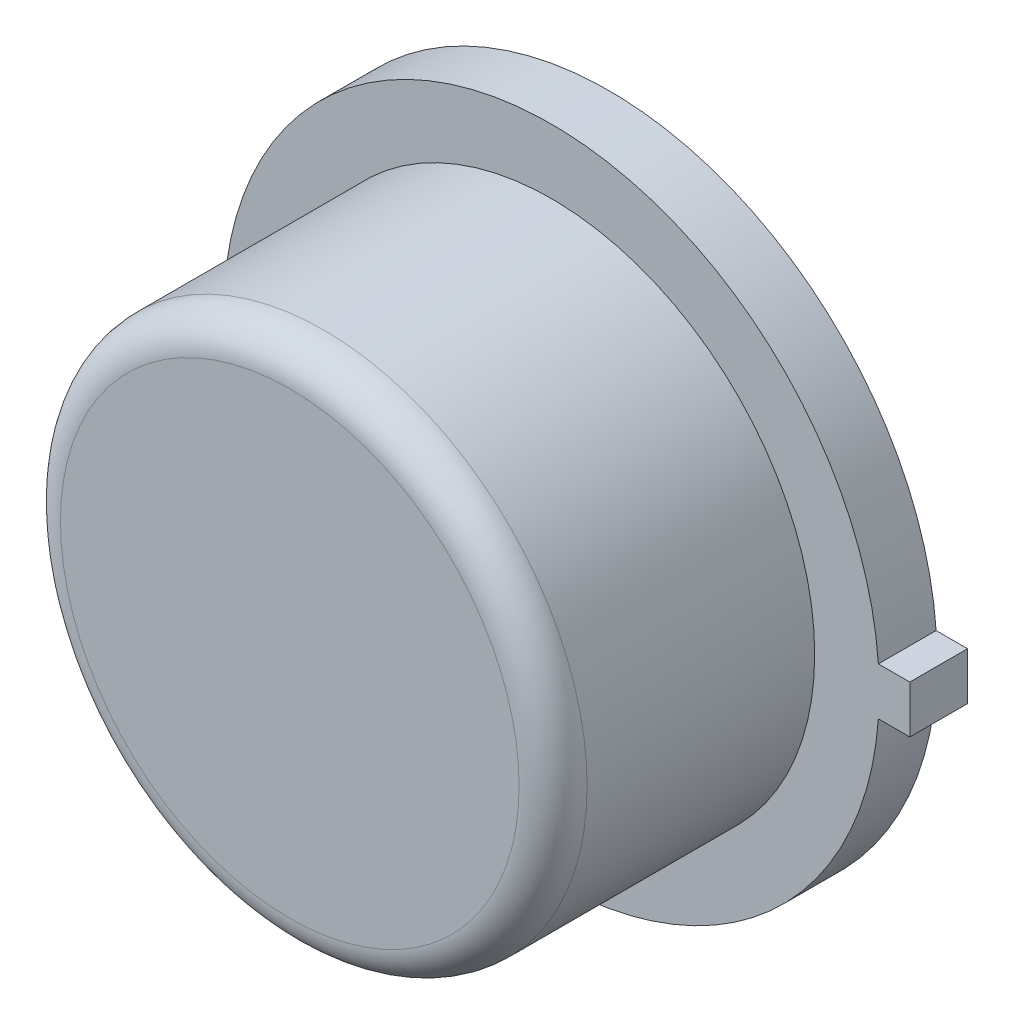
ISO-10303-21;
HEADER;
FILE_DESCRIPTION(('STEP AP214'),'2;1');
FILE_NAME('part.step','',(''),(''),'','','');
FILE_SCHEMA(('AUTOMOTIVE_DESIGN { 1 0 10303 214 1 1 1 1 }'));
ENDSEC;
DATA;
#1=APPLICATION_CONTEXT('core data for automotive mechanical design processes');
#2=APPLICATION_PROTOCOL_DEFINITION('international standard','automotive_design',2000,#1);
#3=PRODUCT_CONTEXT('',#1,'mechanical');
#4=PRODUCT('Part','Part','',(#3));
#5=PRODUCT_RELATED_PRODUCT_CATEGORY('part','',(#4));
#6=PRODUCT_DEFINITION_FORMATION('','',#4);
#7=PRODUCT_DEFINITION_CONTEXT('part definition',#1,'design');
#8=PRODUCT_DEFINITION('design','',#6,#7);
#9=PRODUCT_DEFINITION_SHAPE('','',#8);
#10=(LENGTH_UNIT() NAMED_UNIT(*) SI_UNIT(.MILLI.,.METRE.));
#11=(NAMED_UNIT(*) PLANE_ANGLE_UNIT() SI_UNIT($,.RADIAN.));
#12=(NAMED_UNIT(*) SI_UNIT($,.STERADIAN.) SOLID_ANGLE_UNIT());
#13=UNCERTAINTY_MEASURE_WITH_UNIT(LENGTH_MEASURE(1.E-05),#10,'distance_accuracy_value','');
#14=(GEOMETRIC_REPRESENTATION_CONTEXT(3) GLOBAL_UNCERTAINTY_ASSIGNED_CONTEXT((#13)) GLOBAL_UNIT_ASSIGNED_CONTEXT((#10,
#11,#12)) REPRESENTATION_CONTEXT('',''));
#15=CARTESIAN_POINT('',(0.,0.,0.));
#16=DIRECTION('',(0.,0.,1.));
#17=DIRECTION('',(1.,0.,0.));
#18=AXIS2_PLACEMENT_3D('',#15,#16,#17);
#19=CARTESIAN_POINT('',(-0.00322860507148085,-5.53029106093277,0.));
#20=DIRECTION('',(0.,0.,1.));
#21=DIRECTION('',(1.,0.,0.));
#22=AXIS2_PLACEMENT_3D('',#19,#20,#21);
#23=PLANE('',#22);
#24=DIRECTION('',(1.,0.,0.));
#25=VECTOR('',#24,1.);
#26=CARTESIAN_POINT('',(-0.0032286050714822,0.177799999999999,0.));
#27=LINE('',#26,#25);
#28=CARTESIAN_POINT('',(2.44464278985704,0.177799999999999,0.));
#29=VERTEX_POINT('',#28);
#30=CARTESIAN_POINT('',(2.6797,0.177799999999999,0.));
#31=VERTEX_POINT('',#30);
#32=EDGE_CURVE('E102',#29,#31,#27,.T.);
#33=ORIENTED_EDGE('',*,*,#32,.T.);
#34=DIRECTION('',(0.,-1.,0.));
#35=VECTOR('',#34,1.);
#36=CARTESIAN_POINT('',(2.6797,-5.53029106093277,0.));
#37=LINE('',#36,#35);
#38=CARTESIAN_POINT('',(2.6797,-0.1778,0.));
#39=VERTEX_POINT('',#38);
#40=EDGE_CURVE('E108',#31,#39,#37,.T.);
#41=ORIENTED_EDGE('',*,*,#40,.T.);
#42=DIRECTION('',(-1.,0.,0.));
#43=VECTOR('',#42,1.);
#44=CARTESIAN_POINT('',(-0.00322860507148085,-0.1778,0.));
#45=LINE('',#44,#43);
#46=CARTESIAN_POINT('',(2.44464278985704,-0.1778,0.));
#47=VERTEX_POINT('',#46);
#48=EDGE_CURVE('E106',#39,#47,#45,.T.);
#49=ORIENTED_EDGE('',*,*,#48,.T.);
#50=CARTESIAN_POINT('',(0.,0.,0.));
#51=DIRECTION('',(0.,0.,1.));
#52=DIRECTION('',(1.,0.,0.));
#53=AXIS2_PLACEMENT_3D('',#50,#51,#52);
#54=CIRCLE('',#53,2.4511);
#55=EDGE_CURVE('E92',#29,#47,#54,.T.);
#56=ORIENTED_EDGE('',*,*,#55,.F.);
#57=EDGE_LOOP('',(#33,#41,#49,#56));
#58=FACE_BOUND('',#57,.T.);
#59=CARTESIAN_POINT('',(0.,0.,0.));
#60=DIRECTION('',(0.,0.,1.));
#61=DIRECTION('',(1.,0.,0.));
#62=AXIS2_PLACEMENT_3D('',#59,#60,#61);
#63=CIRCLE('',#62,1.75756648099992);
#64=CARTESIAN_POINT('',(1.75756648099992,0.,0.));
#65=VERTEX_POINT('',#64);
#66=EDGE_CURVE('E114',#65,#65,#63,.F.);
#67=ORIENTED_EDGE('',*,*,#66,.F.);
#68=EDGE_LOOP('',(#67));
#69=FACE_BOUND('',#68,.T.);
#70=ADVANCED_FACE('F33',(#58,#69),#23,.F.);
#71=CARTESIAN_POINT('',(-0.00322860507148085,-5.53029106093277,0.4318));
#72=DIRECTION('',(0.,0.,1.));
#73=DIRECTION('',(1.,0.,0.));
#74=AXIS2_PLACEMENT_3D('',#71,#72,#73);
#75=PLANE('',#74);
#76=DIRECTION('',(1.,0.,0.));
#77=VECTOR('',#76,1.);
#78=CARTESIAN_POINT('',(-0.0032286050714822,0.177799999999999,0.4318));
#79=LINE('',#78,#77);
#80=CARTESIAN_POINT('',(2.44464278985704,0.177799999999999,0.4318));
#81=VERTEX_POINT('',#80);
#82=CARTESIAN_POINT('',(2.6797,0.177799999999999,0.4318));
#83=VERTEX_POINT('',#82);
#84=EDGE_CURVE('E85',#81,#83,#79,.T.);
#85=ORIENTED_EDGE('',*,*,#84,.F.);
#86=CARTESIAN_POINT('',(0.,0.,0.4318));
#87=DIRECTION('',(0.,0.,1.));
#88=DIRECTION('',(1.,0.,0.));
#89=AXIS2_PLACEMENT_3D('',#86,#87,#88);
#90=CIRCLE('',#89,2.4511);
#91=CARTESIAN_POINT('',(2.44464278985704,-0.1778,0.4318));
#92=VERTEX_POINT('',#91);
#93=EDGE_CURVE('E78',#81,#92,#90,.T.);
#94=ORIENTED_EDGE('',*,*,#93,.T.);
#95=DIRECTION('',(-1.,0.,0.));
#96=VECTOR('',#95,1.);
#97=CARTESIAN_POINT('',(-0.00322860507148085,-0.1778,0.4318));
#98=LINE('',#97,#96);
#99=CARTESIAN_POINT('',(2.6797,-0.1778,0.4318));
#100=VERTEX_POINT('',#99);
#101=EDGE_CURVE('E84',#100,#92,#98,.T.);
#102=ORIENTED_EDGE('',*,*,#101,.F.);
#103=DIRECTION('',(0.,-1.,0.));
#104=VECTOR('',#103,1.);
#105=CARTESIAN_POINT('',(2.6797,-5.53029106093277,0.4318));
#106=LINE('',#105,#104);
#107=EDGE_CURVE('E97',#83,#100,#106,.T.);
#108=ORIENTED_EDGE('',*,*,#107,.F.);
#109=EDGE_LOOP('',(#85,#94,#102,#108));
#110=FACE_BOUND('',#109,.T.);
#111=CARTESIAN_POINT('',(0.,0.,0.4318));
#112=DIRECTION('',(0.,0.,1.));
#113=DIRECTION('',(1.,0.,0.));
#114=AXIS2_PLACEMENT_3D('',#111,#112,#113);
#115=CIRCLE('',#114,1.9685);
#116=CARTESIAN_POINT('',(1.9685,0.,0.4318));
#117=VERTEX_POINT('',#116);
#118=EDGE_CURVE('E104',#117,#117,#115,.T.);
#119=ORIENTED_EDGE('',*,*,#118,.F.);
#120=EDGE_LOOP('',(#119));
#121=FACE_BOUND('',#120,.T.);
#122=ADVANCED_FACE('F80',(#110,#121),#75,.T.);
#123=CARTESIAN_POINT('',(-0.0032286050714822,0.177799999999999,0.4318));
#124=DIRECTION('',(0.,1.,0.));
#125=DIRECTION('',(-1.,0.,0.));
#126=AXIS2_PLACEMENT_3D('',#123,#124,#125);
#127=PLANE('',#126);
#128=ORIENTED_EDGE('',*,*,#32,.F.);
#129=DIRECTION('',(0.,0.,-1.));
#130=VECTOR('',#129,1.);
#131=CARTESIAN_POINT('',(2.44464278985704,0.177799999999999,0.4318));
#132=LINE('',#131,#130);
#133=EDGE_CURVE('E72',#81,#29,#132,.T.);
#134=ORIENTED_EDGE('',*,*,#133,.F.);
#135=ORIENTED_EDGE('',*,*,#84,.T.);
#136=DIRECTION('',(0.,0.,-1.));
#137=VECTOR('',#136,1.);
#138=CARTESIAN_POINT('',(2.6797,0.177799999999999,0.4318));
#139=LINE('',#138,#137);
#140=EDGE_CURVE('E50',#83,#31,#139,.T.);
#141=ORIENTED_EDGE('',*,*,#140,.T.);
#142=EDGE_LOOP('',(#128,#134,#135,#141));
#143=FACE_BOUND('',#142,.T.);
#144=ADVANCED_FACE('F137',(#143),#127,.T.);
#145=CARTESIAN_POINT('',(0.,0.,0.4318));
#146=DIRECTION('',(0.,0.,-1.));
#147=DIRECTION('',(-1.,0.,0.));
#148=AXIS2_PLACEMENT_3D('',#145,#146,#147);
#149=CYLINDRICAL_SURFACE('',#148,2.4511);
#150=ORIENTED_EDGE('',*,*,#55,.T.);
#151=DIRECTION('',(0.,0.,-1.));
#152=VECTOR('',#151,1.);
#153=CARTESIAN_POINT('',(2.44464278985704,-0.1778,0.4318));
#154=LINE('',#153,#152);
#155=EDGE_CURVE('E89',#92,#47,#154,.T.);
#156=ORIENTED_EDGE('',*,*,#155,.F.);
#157=ORIENTED_EDGE('',*,*,#93,.F.);
#158=ORIENTED_EDGE('',*,*,#133,.T.);
#159=EDGE_LOOP('',(#150,#156,#157,#158));
#160=FACE_BOUND('',#159,.T.);
#161=ADVANCED_FACE('F90',(#160),#149,.T.);
#162=CARTESIAN_POINT('',(-0.00322860507148085,-0.1778,0.4318));
#163=DIRECTION('',(0.,-1.,0.));
#164=DIRECTION('',(0.,0.,-1.));
#165=AXIS2_PLACEMENT_3D('',#162,#163,#164);
#166=PLANE('',#165);
#167=ORIENTED_EDGE('',*,*,#48,.F.);
#168=DIRECTION('',(0.,0.,-1.));
#169=VECTOR('',#168,1.);
#170=CARTESIAN_POINT('',(2.6797,-0.1778,0.4318));
#171=LINE('',#170,#169);
#172=EDGE_CURVE('E64',#100,#39,#171,.T.);
#173=ORIENTED_EDGE('',*,*,#172,.F.);
#174=ORIENTED_EDGE('',*,*,#101,.T.);
#175=ORIENTED_EDGE('',*,*,#155,.T.);
#176=EDGE_LOOP('',(#167,#173,#174,#175));
#177=FACE_BOUND('',#176,.T.);
#178=ADVANCED_FACE('F96',(#177),#166,.T.);
#179=CARTESIAN_POINT('',(2.6797,-5.53029106093277,0.4318));
#180=DIRECTION('',(1.,0.,0.));
#181=DIRECTION('',(0.,0.,-1.));
#182=AXIS2_PLACEMENT_3D('',#179,#180,#181);
#183=PLANE('',#182);
#184=ORIENTED_EDGE('',*,*,#40,.F.);
#185=ORIENTED_EDGE('',*,*,#140,.F.);
#186=ORIENTED_EDGE('',*,*,#107,.T.);
#187=ORIENTED_EDGE('',*,*,#172,.T.);
#188=EDGE_LOOP('',(#184,#185,#186,#187));
#189=FACE_BOUND('',#188,.T.);
#190=ADVANCED_FACE('F142',(#189),#183,.T.);
#191=CARTESIAN_POINT('',(0.,0.,2.3876));
#192=DIRECTION('',(0.,0.,-1.));
#193=DIRECTION('',(-1.,0.,0.));
#194=AXIS2_PLACEMENT_3D('',#191,#192,#193);
#195=CYLINDRICAL_SURFACE('',#194,1.9685);
#196=CARTESIAN_POINT('',(0.,0.,2.1336));
#197=DIRECTION('',(0.,0.,1.));
#198=DIRECTION('',(1.,0.,0.));
#199=AXIS2_PLACEMENT_3D('',#196,#197,#198);
#200=CIRCLE('',#199,1.9685);
#201=CARTESIAN_POINT('',(1.9685,0.,2.1336));
#202=VERTEX_POINT('',#201);
#203=EDGE_CURVE('E11',#202,#202,#200,.F.);
#204=ORIENTED_EDGE('',*,*,#203,.T.);
#205=EDGE_LOOP('',(#204));
#206=FACE_BOUND('',#205,.T.);
#207=ORIENTED_EDGE('',*,*,#118,.T.);
#208=EDGE_LOOP('',(#207));
#209=FACE_BOUND('',#208,.T.);
#210=ADVANCED_FACE('F145',(#206,#209),#195,.T.);
#211=CARTESIAN_POINT('',(0.,0.,2.3876));
#212=DIRECTION('',(0.,0.,1.));
#213=DIRECTION('',(1.,0.,0.));
#214=AXIS2_PLACEMENT_3D('',#211,#212,#213);
#215=PLANE('',#214);
#216=CARTESIAN_POINT('',(0.,0.,2.3876));
#217=DIRECTION('',(0.,0.,1.));
#218=DIRECTION('',(1.,0.,0.));
#219=AXIS2_PLACEMENT_3D('',#216,#217,#218);
#220=CIRCLE('',#219,1.7145);
#221=CARTESIAN_POINT('',(1.7145,0.,2.3876));
#222=VERTEX_POINT('',#221);
#223=EDGE_CURVE('E42',#222,#222,#220,.T.);
#224=ORIENTED_EDGE('',*,*,#223,.T.);
#225=EDGE_LOOP('',(#224));
#226=FACE_BOUND('',#225,.T.);
#227=ADVANCED_FACE('F119',(#226),#215,.T.);
#228=CARTESIAN_POINT('',(0.,0.,-0.00254));
#229=DIRECTION('',(0.,0.,1.));
#230=DIRECTION('',(1.,0.,0.));
#231=AXIS2_PLACEMENT_3D('',#228,#229,#230);
#232=CYLINDRICAL_SURFACE('',#231,1.75756648099992);
#233=CARTESIAN_POINT('',(0.,0.,-0.00254));
#234=DIRECTION('',(0.,0.,-1.));
#235=DIRECTION('',(-1.,0.,0.));
#236=AXIS2_PLACEMENT_3D('',#233,#234,#235);
#237=CIRCLE('',#236,1.75756648099992);
#238=CARTESIAN_POINT('',(-1.75756648099992,0.,-0.00254));
#239=VERTEX_POINT('',#238);
#240=EDGE_CURVE('E232',#239,#239,#237,.T.);
#241=ORIENTED_EDGE('',*,*,#240,.F.);
#242=EDGE_LOOP('',(#241));
#243=FACE_BOUND('',#242,.T.);
#244=ORIENTED_EDGE('',*,*,#66,.T.);
#245=EDGE_LOOP('',(#244));
#246=FACE_BOUND('',#245,.T.);
#247=ADVANCED_FACE('F127',(#243,#246),#232,.T.);
#248=CARTESIAN_POINT('',(0.,0.,-0.00254));
#249=DIRECTION('',(0.,0.,-1.));
#250=DIRECTION('',(-1.,0.,0.));
#251=AXIS2_PLACEMENT_3D('',#248,#249,#250);
#252=PLANE('',#251);
#253=ORIENTED_EDGE('',*,*,#240,.T.);
#254=EDGE_LOOP('',(#253));
#255=FACE_BOUND('',#254,.T.);
#256=ADVANCED_FACE('F122',(#255),#252,.T.);
#257=CARTESIAN_POINT('',(0.,0.,2.1336));
#258=DIRECTION('',(0.,0.,1.));
#259=DIRECTION('',(1.,0.,0.));
#260=AXIS2_PLACEMENT_3D('',#257,#258,#259);
#261=TOROIDAL_SURFACE('',#260,1.7145,0.254);
#262=ORIENTED_EDGE('',*,*,#203,.F.);
#263=EDGE_LOOP('',(#262));
#264=FACE_BOUND('',#263,.T.);
#265=ORIENTED_EDGE('',*,*,#223,.F.);
#266=EDGE_LOOP('',(#265));
#267=FACE_BOUND('',#266,.T.);
#268=ADVANCED_FACE('F35',(#264,#267),#261,.T.);
#269=CLOSED_SHELL('',(#70,#122,#144,#161,#178,#190,#210,#227,#247,#256,#268));
#270=MANIFOLD_SOLID_BREP('B2',#269);
#271=ADVANCED_BREP_SHAPE_REPRESENTATION('',(#18,#270),#14);
#272=SHAPE_DEFINITION_REPRESENTATION(#9,#271);
ENDSEC;
END-ISO-10303-21;
